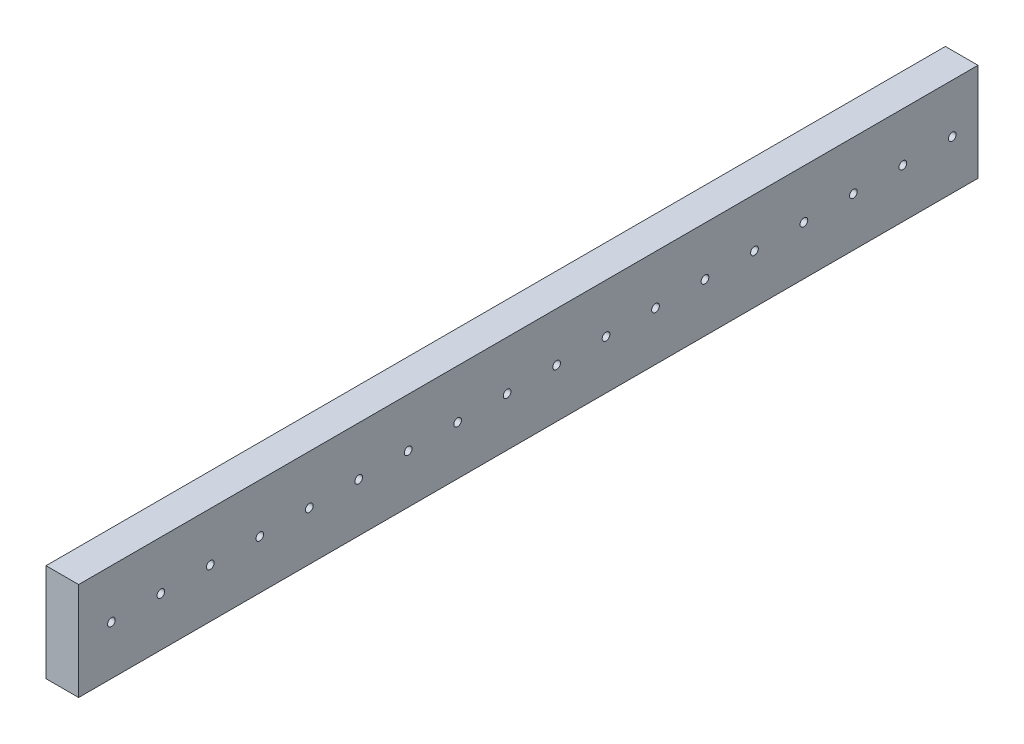
ISO-10303-21;
HEADER;
FILE_DESCRIPTION(('STEP AP214'),'2;1');
FILE_NAME('part.step','',(''),(''),'','','');
FILE_SCHEMA(('AUTOMOTIVE_DESIGN { 1 0 10303 214 1 1 1 1 }'));
ENDSEC;
DATA;
#1=APPLICATION_CONTEXT('core data for automotive mechanical design processes');
#2=APPLICATION_PROTOCOL_DEFINITION('international standard','automotive_design',2000,#1);
#3=PRODUCT_CONTEXT('',#1,'mechanical');
#4=PRODUCT('Part','Part','',(#3));
#5=PRODUCT_RELATED_PRODUCT_CATEGORY('part','',(#4));
#6=PRODUCT_DEFINITION_FORMATION('','',#4);
#7=PRODUCT_DEFINITION_CONTEXT('part definition',#1,'design');
#8=PRODUCT_DEFINITION('design','',#6,#7);
#9=PRODUCT_DEFINITION_SHAPE('','',#8);
#10=(LENGTH_UNIT() NAMED_UNIT(*) SI_UNIT(.MILLI.,.METRE.));
#11=(NAMED_UNIT(*) PLANE_ANGLE_UNIT() SI_UNIT($,.RADIAN.));
#12=(NAMED_UNIT(*) SI_UNIT($,.STERADIAN.) SOLID_ANGLE_UNIT());
#13=UNCERTAINTY_MEASURE_WITH_UNIT(LENGTH_MEASURE(1.E-05),#10,'distance_accuracy_value','');
#14=(GEOMETRIC_REPRESENTATION_CONTEXT(3) GLOBAL_UNCERTAINTY_ASSIGNED_CONTEXT((#13)) GLOBAL_UNIT_ASSIGNED_CONTEXT((#10,
#11,#12)) REPRESENTATION_CONTEXT('',''));
#15=CARTESIAN_POINT('',(0.,0.,0.));
#16=DIRECTION('',(0.,0.,1.));
#17=DIRECTION('',(1.,0.,0.));
#18=AXIS2_PLACEMENT_3D('',#15,#16,#17);
#19=CARTESIAN_POINT('',(12.7,-38.1,-700.));
#20=DIRECTION('',(1.,0.,0.));
#21=DIRECTION('',(0.,0.,-1.));
#22=AXIS2_PLACEMENT_3D('',#19,#20,#21);
#23=PLANE('',#22);
#24=CARTESIAN_POINT('',(12.7,0.,-25.5));
#25=DIRECTION('',(-1.,0.,0.));
#26=DIRECTION('',(0.,0.,1.));
#27=AXIS2_PLACEMENT_3D('',#24,#25,#26);
#28=CIRCLE('',#27,3.00000000000005);
#29=CARTESIAN_POINT('',(12.7,0.,-22.4999999999999));
#30=VERTEX_POINT('',#29);
#31=EDGE_CURVE('E205',#30,#30,#28,.T.);
#32=ORIENTED_EDGE('',*,*,#31,.T.);
#33=EDGE_LOOP('',(#32));
#34=FACE_BOUND('',#33,.T.);
#35=CARTESIAN_POINT('',(12.7,0.,-102.5));
#36=DIRECTION('',(-1.,0.,0.));
#37=DIRECTION('',(0.,0.,1.));
#38=AXIS2_PLACEMENT_3D('',#35,#36,#37);
#39=CIRCLE('',#38,3.00000000000005);
#40=CARTESIAN_POINT('',(12.7,0.,-99.4999999999999));
#41=VERTEX_POINT('',#40);
#42=EDGE_CURVE('E213',#41,#41,#39,.T.);
#43=ORIENTED_EDGE('',*,*,#42,.T.);
#44=EDGE_LOOP('',(#43));
#45=FACE_BOUND('',#44,.T.);
#46=CARTESIAN_POINT('',(12.7,0.,-141.));
#47=DIRECTION('',(-1.,0.,0.));
#48=DIRECTION('',(0.,0.,1.));
#49=AXIS2_PLACEMENT_3D('',#46,#47,#48);
#50=CIRCLE('',#49,3.00000000000005);
#51=CARTESIAN_POINT('',(12.7,0.,-138.));
#52=VERTEX_POINT('',#51);
#53=EDGE_CURVE('E219',#52,#52,#50,.T.);
#54=ORIENTED_EDGE('',*,*,#53,.T.);
#55=EDGE_LOOP('',(#54));
#56=FACE_BOUND('',#55,.T.);
#57=CARTESIAN_POINT('',(12.7,0.,-179.5));
#58=DIRECTION('',(-1.,0.,0.));
#59=DIRECTION('',(0.,0.,1.));
#60=AXIS2_PLACEMENT_3D('',#57,#58,#59);
#61=CIRCLE('',#60,3.00000000000005);
#62=CARTESIAN_POINT('',(12.7,0.,-176.5));
#63=VERTEX_POINT('',#62);
#64=EDGE_CURVE('E225',#63,#63,#61,.T.);
#65=ORIENTED_EDGE('',*,*,#64,.T.);
#66=EDGE_LOOP('',(#65));
#67=FACE_BOUND('',#66,.T.);
#68=CARTESIAN_POINT('',(12.7,0.,-218.));
#69=DIRECTION('',(-1.,0.,0.));
#70=DIRECTION('',(0.,0.,1.));
#71=AXIS2_PLACEMENT_3D('',#68,#69,#70);
#72=CIRCLE('',#71,3.00000000000005);
#73=CARTESIAN_POINT('',(12.7,0.,-215.));
#74=VERTEX_POINT('',#73);
#75=EDGE_CURVE('E231',#74,#74,#72,.T.);
#76=ORIENTED_EDGE('',*,*,#75,.T.);
#77=EDGE_LOOP('',(#76));
#78=FACE_BOUND('',#77,.T.);
#79=CARTESIAN_POINT('',(12.7,0.,-256.5));
#80=DIRECTION('',(-1.,0.,0.));
#81=DIRECTION('',(0.,0.,1.));
#82=AXIS2_PLACEMENT_3D('',#79,#80,#81);
#83=CIRCLE('',#82,3.00000000000005);
#84=CARTESIAN_POINT('',(12.7,0.,-253.5));
#85=VERTEX_POINT('',#84);
#86=EDGE_CURVE('E237',#85,#85,#83,.T.);
#87=ORIENTED_EDGE('',*,*,#86,.T.);
#88=EDGE_LOOP('',(#87));
#89=FACE_BOUND('',#88,.T.);
#90=CARTESIAN_POINT('',(12.7,0.,-295.));
#91=DIRECTION('',(-1.,0.,0.));
#92=DIRECTION('',(0.,0.,1.));
#93=AXIS2_PLACEMENT_3D('',#90,#91,#92);
#94=CIRCLE('',#93,3.00000000000005);
#95=CARTESIAN_POINT('',(12.7,0.,-292.));
#96=VERTEX_POINT('',#95);
#97=EDGE_CURVE('E243',#96,#96,#94,.T.);
#98=ORIENTED_EDGE('',*,*,#97,.T.);
#99=EDGE_LOOP('',(#98));
#100=FACE_BOUND('',#99,.T.);
#101=CARTESIAN_POINT('',(12.7,0.,-333.5));
#102=DIRECTION('',(-1.,0.,0.));
#103=DIRECTION('',(0.,0.,1.));
#104=AXIS2_PLACEMENT_3D('',#101,#102,#103);
#105=CIRCLE('',#104,3.00000000000005);
#106=CARTESIAN_POINT('',(12.7,0.,-330.5));
#107=VERTEX_POINT('',#106);
#108=EDGE_CURVE('E249',#107,#107,#105,.T.);
#109=ORIENTED_EDGE('',*,*,#108,.T.);
#110=EDGE_LOOP('',(#109));
#111=FACE_BOUND('',#110,.T.);
#112=CARTESIAN_POINT('',(12.7,0.,-372.));
#113=DIRECTION('',(-1.,0.,0.));
#114=DIRECTION('',(0.,0.,1.));
#115=AXIS2_PLACEMENT_3D('',#112,#113,#114);
#116=CIRCLE('',#115,3.00000000000005);
#117=CARTESIAN_POINT('',(12.7,0.,-369.));
#118=VERTEX_POINT('',#117);
#119=EDGE_CURVE('E255',#118,#118,#116,.T.);
#120=ORIENTED_EDGE('',*,*,#119,.T.);
#121=EDGE_LOOP('',(#120));
#122=FACE_BOUND('',#121,.T.);
#123=CARTESIAN_POINT('',(12.7,0.,-410.5));
#124=DIRECTION('',(-1.,0.,0.));
#125=DIRECTION('',(0.,0.,1.));
#126=AXIS2_PLACEMENT_3D('',#123,#124,#125);
#127=CIRCLE('',#126,3.00000000000005);
#128=CARTESIAN_POINT('',(12.7,0.,-407.5));
#129=VERTEX_POINT('',#128);
#130=EDGE_CURVE('E261',#129,#129,#127,.T.);
#131=ORIENTED_EDGE('',*,*,#130,.T.);
#132=EDGE_LOOP('',(#131));
#133=FACE_BOUND('',#132,.T.);
#134=CARTESIAN_POINT('',(12.7,0.,-449.));
#135=DIRECTION('',(-1.,0.,0.));
#136=DIRECTION('',(0.,0.,1.));
#137=AXIS2_PLACEMENT_3D('',#134,#135,#136);
#138=CIRCLE('',#137,3.00000000000005);
#139=CARTESIAN_POINT('',(12.7,0.,-446.));
#140=VERTEX_POINT('',#139);
#141=EDGE_CURVE('E267',#140,#140,#138,.T.);
#142=ORIENTED_EDGE('',*,*,#141,.T.);
#143=EDGE_LOOP('',(#142));
#144=FACE_BOUND('',#143,.T.);
#145=CARTESIAN_POINT('',(12.7,0.,-487.5));
#146=DIRECTION('',(-1.,0.,0.));
#147=DIRECTION('',(0.,0.,1.));
#148=AXIS2_PLACEMENT_3D('',#145,#146,#147);
#149=CIRCLE('',#148,3.00000000000005);
#150=CARTESIAN_POINT('',(12.7,0.,-484.5));
#151=VERTEX_POINT('',#150);
#152=EDGE_CURVE('E273',#151,#151,#149,.T.);
#153=ORIENTED_EDGE('',*,*,#152,.T.);
#154=EDGE_LOOP('',(#153));
#155=FACE_BOUND('',#154,.T.);
#156=CARTESIAN_POINT('',(12.7,0.,-526.));
#157=DIRECTION('',(-1.,0.,0.));
#158=DIRECTION('',(0.,0.,1.));
#159=AXIS2_PLACEMENT_3D('',#156,#157,#158);
#160=CIRCLE('',#159,3.00000000000005);
#161=CARTESIAN_POINT('',(12.7,0.,-523.));
#162=VERTEX_POINT('',#161);
#163=EDGE_CURVE('E279',#162,#162,#160,.T.);
#164=ORIENTED_EDGE('',*,*,#163,.T.);
#165=EDGE_LOOP('',(#164));
#166=FACE_BOUND('',#165,.T.);
#167=CARTESIAN_POINT('',(12.7,0.,-564.5));
#168=DIRECTION('',(-1.,0.,0.));
#169=DIRECTION('',(0.,0.,1.));
#170=AXIS2_PLACEMENT_3D('',#167,#168,#169);
#171=CIRCLE('',#170,2.99999999999993);
#172=CARTESIAN_POINT('',(12.7,0.,-561.5));
#173=VERTEX_POINT('',#172);
#174=EDGE_CURVE('E285',#173,#173,#171,.T.);
#175=ORIENTED_EDGE('',*,*,#174,.T.);
#176=EDGE_LOOP('',(#175));
#177=FACE_BOUND('',#176,.T.);
#178=CARTESIAN_POINT('',(12.7,0.,-603.));
#179=DIRECTION('',(-1.,0.,0.));
#180=DIRECTION('',(0.,0.,1.));
#181=AXIS2_PLACEMENT_3D('',#178,#179,#180);
#182=CIRCLE('',#181,3.00000000000005);
#183=CARTESIAN_POINT('',(12.7,0.,-600.));
#184=VERTEX_POINT('',#183);
#185=EDGE_CURVE('E291',#184,#184,#182,.T.);
#186=ORIENTED_EDGE('',*,*,#185,.T.);
#187=EDGE_LOOP('',(#186));
#188=FACE_BOUND('',#187,.T.);
#189=CARTESIAN_POINT('',(12.7,0.,-641.5));
#190=DIRECTION('',(-1.,0.,0.));
#191=DIRECTION('',(0.,0.,1.));
#192=AXIS2_PLACEMENT_3D('',#189,#190,#191);
#193=CIRCLE('',#192,3.00000000000005);
#194=CARTESIAN_POINT('',(12.7,0.,-638.5));
#195=VERTEX_POINT('',#194);
#196=EDGE_CURVE('E297',#195,#195,#193,.T.);
#197=ORIENTED_EDGE('',*,*,#196,.T.);
#198=EDGE_LOOP('',(#197));
#199=FACE_BOUND('',#198,.T.);
#200=CARTESIAN_POINT('',(12.7,0.,-63.9999999999999));
#201=DIRECTION('',(-1.,0.,0.));
#202=DIRECTION('',(0.,0.,1.));
#203=AXIS2_PLACEMENT_3D('',#200,#201,#202);
#204=CIRCLE('',#203,3.00000000000005);
#205=CARTESIAN_POINT('',(12.7,0.,-60.9999999999999));
#206=VERTEX_POINT('',#205);
#207=EDGE_CURVE('E303',#206,#206,#204,.T.);
#208=ORIENTED_EDGE('',*,*,#207,.T.);
#209=EDGE_LOOP('',(#208));
#210=FACE_BOUND('',#209,.T.);
#211=CARTESIAN_POINT('',(12.7,0.,-680.));
#212=DIRECTION('',(-1.,0.,0.));
#213=DIRECTION('',(0.,0.,1.));
#214=AXIS2_PLACEMENT_3D('',#211,#212,#213);
#215=CIRCLE('',#214,3.00000000000005);
#216=CARTESIAN_POINT('',(12.7,0.,-677.));
#217=VERTEX_POINT('',#216);
#218=EDGE_CURVE('E102',#217,#217,#215,.T.);
#219=ORIENTED_EDGE('',*,*,#218,.T.);
#220=EDGE_LOOP('',(#219));
#221=FACE_BOUND('',#220,.T.);
#222=DIRECTION('',(0.,1.,0.));
#223=VECTOR('',#222,1.);
#224=CARTESIAN_POINT('',(12.7,-38.1,0.));
#225=LINE('',#224,#223);
#226=CARTESIAN_POINT('',(12.7,-38.1,0.));
#227=VERTEX_POINT('',#226);
#228=CARTESIAN_POINT('',(12.7,38.1,0.));
#229=VERTEX_POINT('',#228);
#230=EDGE_CURVE('E98',#227,#229,#225,.T.);
#231=ORIENTED_EDGE('',*,*,#230,.F.);
#232=DIRECTION('',(0.,0.,1.));
#233=VECTOR('',#232,1.);
#234=CARTESIAN_POINT('',(12.7,-38.1,-700.));
#235=LINE('',#234,#233);
#236=CARTESIAN_POINT('',(12.7,-38.1,-700.));
#237=VERTEX_POINT('',#236);
#238=EDGE_CURVE('E11',#237,#227,#235,.T.);
#239=ORIENTED_EDGE('',*,*,#238,.F.);
#240=DIRECTION('',(0.,1.,0.));
#241=VECTOR('',#240,1.);
#242=CARTESIAN_POINT('',(12.7,-38.1,-700.));
#243=LINE('',#242,#241);
#244=CARTESIAN_POINT('',(12.7,38.1,-700.));
#245=VERTEX_POINT('',#244);
#246=EDGE_CURVE('E91',#237,#245,#243,.T.);
#247=ORIENTED_EDGE('',*,*,#246,.T.);
#248=DIRECTION('',(0.,0.,1.));
#249=VECTOR('',#248,1.);
#250=CARTESIAN_POINT('',(12.7,38.1,-700.));
#251=LINE('',#250,#249);
#252=EDGE_CURVE('E36',#245,#229,#251,.T.);
#253=ORIENTED_EDGE('',*,*,#252,.T.);
#254=EDGE_LOOP('',(#231,#239,#247,#253));
#255=FACE_BOUND('',#254,.T.);
#256=ADVANCED_FACE('F33',(#34,#45,#56,#67,#78,#89,#100,#111,#122,#133,#144,#155,#166,#177,#188,
#199,#210,#221,#255),#23,.T.);
#257=CARTESIAN_POINT('',(-12.7,-38.1,-700.));
#258=DIRECTION('',(0.,-1.,0.));
#259=DIRECTION('',(0.,0.,-1.));
#260=AXIS2_PLACEMENT_3D('',#257,#258,#259);
#261=PLANE('',#260);
#262=DIRECTION('',(1.,0.,0.));
#263=VECTOR('',#262,1.);
#264=CARTESIAN_POINT('',(-12.7,-38.1,0.));
#265=LINE('',#264,#263);
#266=CARTESIAN_POINT('',(-12.7,-38.1,0.));
#267=VERTEX_POINT('',#266);
#268=EDGE_CURVE('E93',#267,#227,#265,.T.);
#269=ORIENTED_EDGE('',*,*,#268,.F.);
#270=DIRECTION('',(0.,0.,1.));
#271=VECTOR('',#270,1.);
#272=CARTESIAN_POINT('',(-12.7,-38.1,-700.));
#273=LINE('',#272,#271);
#274=CARTESIAN_POINT('',(-12.7,-38.1,-700.));
#275=VERTEX_POINT('',#274);
#276=EDGE_CURVE('E42',#275,#267,#273,.T.);
#277=ORIENTED_EDGE('',*,*,#276,.F.);
#278=DIRECTION('',(1.,0.,0.));
#279=VECTOR('',#278,1.);
#280=CARTESIAN_POINT('',(-12.7,-38.1,-700.));
#281=LINE('',#280,#279);
#282=EDGE_CURVE('E88',#275,#237,#281,.T.);
#283=ORIENTED_EDGE('',*,*,#282,.T.);
#284=ORIENTED_EDGE('',*,*,#238,.T.);
#285=EDGE_LOOP('',(#269,#277,#283,#284));
#286=FACE_BOUND('',#285,.T.);
#287=ADVANCED_FACE('F109',(#286),#261,.T.);
#288=CARTESIAN_POINT('',(-12.7,-38.1,-700.));
#289=DIRECTION('',(-1.,0.,0.));
#290=DIRECTION('',(0.,0.,1.));
#291=AXIS2_PLACEMENT_3D('',#288,#289,#290);
#292=PLANE('',#291);
#293=CARTESIAN_POINT('',(-12.7,0.,-25.5));
#294=DIRECTION('',(-1.,0.,0.));
#295=DIRECTION('',(0.,0.,1.));
#296=AXIS2_PLACEMENT_3D('',#293,#294,#295);
#297=CIRCLE('',#296,3.00000000000005);
#298=CARTESIAN_POINT('',(-12.7,0.,-22.4999999999999));
#299=VERTEX_POINT('',#298);
#300=EDGE_CURVE('E208',#299,#299,#297,.T.);
#301=ORIENTED_EDGE('',*,*,#300,.F.);
#302=EDGE_LOOP('',(#301));
#303=FACE_BOUND('',#302,.T.);
#304=CARTESIAN_POINT('',(-12.7,0.,-102.5));
#305=DIRECTION('',(-1.,0.,0.));
#306=DIRECTION('',(0.,0.,1.));
#307=AXIS2_PLACEMENT_3D('',#304,#305,#306);
#308=CIRCLE('',#307,3.00000000000005);
#309=CARTESIAN_POINT('',(-12.7,0.,-99.4999999999999));
#310=VERTEX_POINT('',#309);
#311=EDGE_CURVE('E210',#310,#310,#308,.T.);
#312=ORIENTED_EDGE('',*,*,#311,.F.);
#313=EDGE_LOOP('',(#312));
#314=FACE_BOUND('',#313,.T.);
#315=CARTESIAN_POINT('',(-12.7,0.,-141.));
#316=DIRECTION('',(-1.,0.,0.));
#317=DIRECTION('',(0.,0.,1.));
#318=AXIS2_PLACEMENT_3D('',#315,#316,#317);
#319=CIRCLE('',#318,3.00000000000005);
#320=CARTESIAN_POINT('',(-12.7,0.,-138.));
#321=VERTEX_POINT('',#320);
#322=EDGE_CURVE('E216',#321,#321,#319,.T.);
#323=ORIENTED_EDGE('',*,*,#322,.F.);
#324=EDGE_LOOP('',(#323));
#325=FACE_BOUND('',#324,.T.);
#326=CARTESIAN_POINT('',(-12.7,0.,-179.5));
#327=DIRECTION('',(-1.,0.,0.));
#328=DIRECTION('',(0.,0.,1.));
#329=AXIS2_PLACEMENT_3D('',#326,#327,#328);
#330=CIRCLE('',#329,3.00000000000005);
#331=CARTESIAN_POINT('',(-12.7,0.,-176.5));
#332=VERTEX_POINT('',#331);
#333=EDGE_CURVE('E222',#332,#332,#330,.T.);
#334=ORIENTED_EDGE('',*,*,#333,.F.);
#335=EDGE_LOOP('',(#334));
#336=FACE_BOUND('',#335,.T.);
#337=CARTESIAN_POINT('',(-12.7,0.,-218.));
#338=DIRECTION('',(-1.,0.,0.));
#339=DIRECTION('',(0.,0.,1.));
#340=AXIS2_PLACEMENT_3D('',#337,#338,#339);
#341=CIRCLE('',#340,3.00000000000005);
#342=CARTESIAN_POINT('',(-12.7,0.,-215.));
#343=VERTEX_POINT('',#342);
#344=EDGE_CURVE('E228',#343,#343,#341,.T.);
#345=ORIENTED_EDGE('',*,*,#344,.F.);
#346=EDGE_LOOP('',(#345));
#347=FACE_BOUND('',#346,.T.);
#348=CARTESIAN_POINT('',(-12.7,0.,-256.5));
#349=DIRECTION('',(-1.,0.,0.));
#350=DIRECTION('',(0.,0.,1.));
#351=AXIS2_PLACEMENT_3D('',#348,#349,#350);
#352=CIRCLE('',#351,3.00000000000005);
#353=CARTESIAN_POINT('',(-12.7,0.,-253.5));
#354=VERTEX_POINT('',#353);
#355=EDGE_CURVE('E234',#354,#354,#352,.T.);
#356=ORIENTED_EDGE('',*,*,#355,.F.);
#357=EDGE_LOOP('',(#356));
#358=FACE_BOUND('',#357,.T.);
#359=CARTESIAN_POINT('',(-12.7,0.,-295.));
#360=DIRECTION('',(-1.,0.,0.));
#361=DIRECTION('',(0.,0.,1.));
#362=AXIS2_PLACEMENT_3D('',#359,#360,#361);
#363=CIRCLE('',#362,3.00000000000005);
#364=CARTESIAN_POINT('',(-12.7,0.,-292.));
#365=VERTEX_POINT('',#364);
#366=EDGE_CURVE('E240',#365,#365,#363,.T.);
#367=ORIENTED_EDGE('',*,*,#366,.F.);
#368=EDGE_LOOP('',(#367));
#369=FACE_BOUND('',#368,.T.);
#370=CARTESIAN_POINT('',(-12.7,0.,-333.5));
#371=DIRECTION('',(-1.,0.,0.));
#372=DIRECTION('',(0.,0.,1.));
#373=AXIS2_PLACEMENT_3D('',#370,#371,#372);
#374=CIRCLE('',#373,3.00000000000005);
#375=CARTESIAN_POINT('',(-12.7,0.,-330.5));
#376=VERTEX_POINT('',#375);
#377=EDGE_CURVE('E246',#376,#376,#374,.T.);
#378=ORIENTED_EDGE('',*,*,#377,.F.);
#379=EDGE_LOOP('',(#378));
#380=FACE_BOUND('',#379,.T.);
#381=CARTESIAN_POINT('',(-12.7,0.,-372.));
#382=DIRECTION('',(-1.,0.,0.));
#383=DIRECTION('',(0.,0.,1.));
#384=AXIS2_PLACEMENT_3D('',#381,#382,#383);
#385=CIRCLE('',#384,3.00000000000005);
#386=CARTESIAN_POINT('',(-12.7,0.,-369.));
#387=VERTEX_POINT('',#386);
#388=EDGE_CURVE('E252',#387,#387,#385,.T.);
#389=ORIENTED_EDGE('',*,*,#388,.F.);
#390=EDGE_LOOP('',(#389));
#391=FACE_BOUND('',#390,.T.);
#392=CARTESIAN_POINT('',(-12.7,0.,-410.5));
#393=DIRECTION('',(-1.,0.,0.));
#394=DIRECTION('',(0.,0.,1.));
#395=AXIS2_PLACEMENT_3D('',#392,#393,#394);
#396=CIRCLE('',#395,3.00000000000005);
#397=CARTESIAN_POINT('',(-12.7,0.,-407.5));
#398=VERTEX_POINT('',#397);
#399=EDGE_CURVE('E258',#398,#398,#396,.T.);
#400=ORIENTED_EDGE('',*,*,#399,.F.);
#401=EDGE_LOOP('',(#400));
#402=FACE_BOUND('',#401,.T.);
#403=CARTESIAN_POINT('',(-12.7,0.,-449.));
#404=DIRECTION('',(-1.,0.,0.));
#405=DIRECTION('',(0.,0.,1.));
#406=AXIS2_PLACEMENT_3D('',#403,#404,#405);
#407=CIRCLE('',#406,3.00000000000005);
#408=CARTESIAN_POINT('',(-12.7,0.,-446.));
#409=VERTEX_POINT('',#408);
#410=EDGE_CURVE('E264',#409,#409,#407,.T.);
#411=ORIENTED_EDGE('',*,*,#410,.F.);
#412=EDGE_LOOP('',(#411));
#413=FACE_BOUND('',#412,.T.);
#414=CARTESIAN_POINT('',(-12.7,0.,-487.5));
#415=DIRECTION('',(-1.,0.,0.));
#416=DIRECTION('',(0.,0.,1.));
#417=AXIS2_PLACEMENT_3D('',#414,#415,#416);
#418=CIRCLE('',#417,3.00000000000005);
#419=CARTESIAN_POINT('',(-12.7,0.,-484.5));
#420=VERTEX_POINT('',#419);
#421=EDGE_CURVE('E270',#420,#420,#418,.T.);
#422=ORIENTED_EDGE('',*,*,#421,.F.);
#423=EDGE_LOOP('',(#422));
#424=FACE_BOUND('',#423,.T.);
#425=CARTESIAN_POINT('',(-12.7,0.,-526.));
#426=DIRECTION('',(-1.,0.,0.));
#427=DIRECTION('',(0.,0.,1.));
#428=AXIS2_PLACEMENT_3D('',#425,#426,#427);
#429=CIRCLE('',#428,3.00000000000005);
#430=CARTESIAN_POINT('',(-12.7,0.,-523.));
#431=VERTEX_POINT('',#430);
#432=EDGE_CURVE('E276',#431,#431,#429,.T.);
#433=ORIENTED_EDGE('',*,*,#432,.F.);
#434=EDGE_LOOP('',(#433));
#435=FACE_BOUND('',#434,.T.);
#436=CARTESIAN_POINT('',(-12.7,0.,-564.5));
#437=DIRECTION('',(-1.,0.,0.));
#438=DIRECTION('',(0.,0.,1.));
#439=AXIS2_PLACEMENT_3D('',#436,#437,#438);
#440=CIRCLE('',#439,2.99999999999993);
#441=CARTESIAN_POINT('',(-12.7,0.,-561.5));
#442=VERTEX_POINT('',#441);
#443=EDGE_CURVE('E282',#442,#442,#440,.T.);
#444=ORIENTED_EDGE('',*,*,#443,.F.);
#445=EDGE_LOOP('',(#444));
#446=FACE_BOUND('',#445,.T.);
#447=CARTESIAN_POINT('',(-12.7,0.,-603.));
#448=DIRECTION('',(-1.,0.,0.));
#449=DIRECTION('',(0.,0.,1.));
#450=AXIS2_PLACEMENT_3D('',#447,#448,#449);
#451=CIRCLE('',#450,3.00000000000005);
#452=CARTESIAN_POINT('',(-12.7,0.,-600.));
#453=VERTEX_POINT('',#452);
#454=EDGE_CURVE('E288',#453,#453,#451,.T.);
#455=ORIENTED_EDGE('',*,*,#454,.F.);
#456=EDGE_LOOP('',(#455));
#457=FACE_BOUND('',#456,.T.);
#458=CARTESIAN_POINT('',(-12.7,0.,-641.5));
#459=DIRECTION('',(-1.,0.,0.));
#460=DIRECTION('',(0.,0.,1.));
#461=AXIS2_PLACEMENT_3D('',#458,#459,#460);
#462=CIRCLE('',#461,3.00000000000005);
#463=CARTESIAN_POINT('',(-12.7,0.,-638.5));
#464=VERTEX_POINT('',#463);
#465=EDGE_CURVE('E294',#464,#464,#462,.T.);
#466=ORIENTED_EDGE('',*,*,#465,.F.);
#467=EDGE_LOOP('',(#466));
#468=FACE_BOUND('',#467,.T.);
#469=CARTESIAN_POINT('',(-12.7,0.,-63.9999999999999));
#470=DIRECTION('',(-1.,0.,0.));
#471=DIRECTION('',(0.,0.,1.));
#472=AXIS2_PLACEMENT_3D('',#469,#470,#471);
#473=CIRCLE('',#472,3.00000000000005);
#474=CARTESIAN_POINT('',(-12.7,0.,-60.9999999999999));
#475=VERTEX_POINT('',#474);
#476=EDGE_CURVE('E300',#475,#475,#473,.T.);
#477=ORIENTED_EDGE('',*,*,#476,.F.);
#478=EDGE_LOOP('',(#477));
#479=FACE_BOUND('',#478,.T.);
#480=CARTESIAN_POINT('',(-12.7,0.,-680.));
#481=DIRECTION('',(-1.,0.,0.));
#482=DIRECTION('',(0.,0.,1.));
#483=AXIS2_PLACEMENT_3D('',#480,#481,#482);
#484=CIRCLE('',#483,3.00000000000005);
#485=CARTESIAN_POINT('',(-12.7,0.,-677.));
#486=VERTEX_POINT('',#485);
#487=EDGE_CURVE('E306',#486,#486,#484,.T.);
#488=ORIENTED_EDGE('',*,*,#487,.F.);
#489=EDGE_LOOP('',(#488));
#490=FACE_BOUND('',#489,.T.);
#491=DIRECTION('',(0.,-1.,0.));
#492=VECTOR('',#491,1.);
#493=CARTESIAN_POINT('',(-12.7,-38.1,0.));
#494=LINE('',#493,#492);
#495=CARTESIAN_POINT('',(-12.7,38.1,0.));
#496=VERTEX_POINT('',#495);
#497=EDGE_CURVE('E83',#496,#267,#494,.T.);
#498=ORIENTED_EDGE('',*,*,#497,.F.);
#499=DIRECTION('',(0.,0.,1.));
#500=VECTOR('',#499,1.);
#501=CARTESIAN_POINT('',(-12.7,38.1,-700.));
#502=LINE('',#501,#500);
#503=CARTESIAN_POINT('',(-12.7,38.1,-700.));
#504=VERTEX_POINT('',#503);
#505=EDGE_CURVE('E78',#504,#496,#502,.T.);
#506=ORIENTED_EDGE('',*,*,#505,.F.);
#507=DIRECTION('',(0.,-1.,0.));
#508=VECTOR('',#507,1.);
#509=CARTESIAN_POINT('',(-12.7,-38.1,-700.));
#510=LINE('',#509,#508);
#511=EDGE_CURVE('E81',#504,#275,#510,.T.);
#512=ORIENTED_EDGE('',*,*,#511,.T.);
#513=ORIENTED_EDGE('',*,*,#276,.T.);
#514=EDGE_LOOP('',(#498,#506,#512,#513));
#515=FACE_BOUND('',#514,.T.);
#516=ADVANCED_FACE('F80',(#303,#314,#325,#336,#347,#358,#369,#380,#391,#402,#413,#424,#435,#446,
#457,#468,#479,#490,#515),#292,.T.);
#517=CARTESIAN_POINT('',(-12.7,38.1,-700.));
#518=DIRECTION('',(0.,1.,0.));
#519=DIRECTION('',(0.,0.,1.));
#520=AXIS2_PLACEMENT_3D('',#517,#518,#519);
#521=PLANE('',#520);
#522=DIRECTION('',(-1.,0.,0.));
#523=VECTOR('',#522,1.);
#524=CARTESIAN_POINT('',(-12.7,38.1,0.));
#525=LINE('',#524,#523);
#526=EDGE_CURVE('E101',#229,#496,#525,.T.);
#527=ORIENTED_EDGE('',*,*,#526,.F.);
#528=ORIENTED_EDGE('',*,*,#252,.F.);
#529=DIRECTION('',(-1.,0.,0.));
#530=VECTOR('',#529,1.);
#531=CARTESIAN_POINT('',(-12.7,38.1,-700.));
#532=LINE('',#531,#530);
#533=EDGE_CURVE('E87',#245,#504,#532,.T.);
#534=ORIENTED_EDGE('',*,*,#533,.T.);
#535=ORIENTED_EDGE('',*,*,#505,.T.);
#536=EDGE_LOOP('',(#527,#528,#534,#535));
#537=FACE_BOUND('',#536,.T.);
#538=ADVANCED_FACE('F90',(#537),#521,.T.);
#539=CARTESIAN_POINT('',(0.,0.,-700.));
#540=DIRECTION('',(0.,0.,-1.));
#541=DIRECTION('',(-1.,0.,0.));
#542=AXIS2_PLACEMENT_3D('',#539,#540,#541);
#543=PLANE('',#542);
#544=ORIENTED_EDGE('',*,*,#246,.F.);
#545=ORIENTED_EDGE('',*,*,#282,.F.);
#546=ORIENTED_EDGE('',*,*,#511,.F.);
#547=ORIENTED_EDGE('',*,*,#533,.F.);
#548=EDGE_LOOP('',(#544,#545,#546,#547));
#549=FACE_BOUND('',#548,.T.);
#550=ADVANCED_FACE('F86',(#549),#543,.T.);
#551=CARTESIAN_POINT('',(0.,0.,0.));
#552=DIRECTION('',(0.,0.,-1.));
#553=DIRECTION('',(-1.,0.,0.));
#554=AXIS2_PLACEMENT_3D('',#551,#552,#553);
#555=PLANE('',#554);
#556=ORIENTED_EDGE('',*,*,#230,.T.);
#557=ORIENTED_EDGE('',*,*,#526,.T.);
#558=ORIENTED_EDGE('',*,*,#497,.T.);
#559=ORIENTED_EDGE('',*,*,#268,.T.);
#560=EDGE_LOOP('',(#556,#557,#558,#559));
#561=FACE_BOUND('',#560,.T.);
#562=ADVANCED_FACE('F108',(#561),#555,.F.);
#563=CARTESIAN_POINT('',(12.7,0.,-680.));
#564=DIRECTION('',(-1.,0.,0.));
#565=DIRECTION('',(0.,0.,1.));
#566=AXIS2_PLACEMENT_3D('',#563,#564,#565);
#567=CYLINDRICAL_SURFACE('',#566,3.00000000000005);
#568=ORIENTED_EDGE('',*,*,#218,.F.);
#569=EDGE_LOOP('',(#568));
#570=FACE_BOUND('',#569,.T.);
#571=ORIENTED_EDGE('',*,*,#487,.T.);
#572=EDGE_LOOP('',(#571));
#573=FACE_BOUND('',#572,.T.);
#574=ADVANCED_FACE('F128',(#570,#573),#567,.F.);
#575=CARTESIAN_POINT('',(12.7,0.,-63.9999999999999));
#576=DIRECTION('',(-1.,0.,0.));
#577=DIRECTION('',(0.,0.,1.));
#578=AXIS2_PLACEMENT_3D('',#575,#576,#577);
#579=CYLINDRICAL_SURFACE('',#578,3.00000000000005);
#580=ORIENTED_EDGE('',*,*,#207,.F.);
#581=EDGE_LOOP('',(#580));
#582=FACE_BOUND('',#581,.T.);
#583=ORIENTED_EDGE('',*,*,#476,.T.);
#584=EDGE_LOOP('',(#583));
#585=FACE_BOUND('',#584,.T.);
#586=ADVANCED_FACE('F132',(#582,#585),#579,.F.);
#587=CARTESIAN_POINT('',(12.7,0.,-641.5));
#588=DIRECTION('',(-1.,0.,0.));
#589=DIRECTION('',(0.,0.,1.));
#590=AXIS2_PLACEMENT_3D('',#587,#588,#589);
#591=CYLINDRICAL_SURFACE('',#590,3.00000000000005);
#592=ORIENTED_EDGE('',*,*,#196,.F.);
#593=EDGE_LOOP('',(#592));
#594=FACE_BOUND('',#593,.T.);
#595=ORIENTED_EDGE('',*,*,#465,.T.);
#596=EDGE_LOOP('',(#595));
#597=FACE_BOUND('',#596,.T.);
#598=ADVANCED_FACE('F136',(#594,#597),#591,.F.);
#599=CARTESIAN_POINT('',(12.7,0.,-603.));
#600=DIRECTION('',(-1.,0.,0.));
#601=DIRECTION('',(0.,0.,1.));
#602=AXIS2_PLACEMENT_3D('',#599,#600,#601);
#603=CYLINDRICAL_SURFACE('',#602,3.00000000000005);
#604=ORIENTED_EDGE('',*,*,#185,.F.);
#605=EDGE_LOOP('',(#604));
#606=FACE_BOUND('',#605,.T.);
#607=ORIENTED_EDGE('',*,*,#454,.T.);
#608=EDGE_LOOP('',(#607));
#609=FACE_BOUND('',#608,.T.);
#610=ADVANCED_FACE('F140',(#606,#609),#603,.F.);
#611=CARTESIAN_POINT('',(12.7,0.,-564.5));
#612=DIRECTION('',(-1.,0.,0.));
#613=DIRECTION('',(0.,0.,1.));
#614=AXIS2_PLACEMENT_3D('',#611,#612,#613);
#615=CYLINDRICAL_SURFACE('',#614,2.99999999999993);
#616=ORIENTED_EDGE('',*,*,#174,.F.);
#617=EDGE_LOOP('',(#616));
#618=FACE_BOUND('',#617,.T.);
#619=ORIENTED_EDGE('',*,*,#443,.T.);
#620=EDGE_LOOP('',(#619));
#621=FACE_BOUND('',#620,.T.);
#622=ADVANCED_FACE('F144',(#618,#621),#615,.F.);
#623=CARTESIAN_POINT('',(12.7,0.,-526.));
#624=DIRECTION('',(-1.,0.,0.));
#625=DIRECTION('',(0.,0.,1.));
#626=AXIS2_PLACEMENT_3D('',#623,#624,#625);
#627=CYLINDRICAL_SURFACE('',#626,3.00000000000005);
#628=ORIENTED_EDGE('',*,*,#163,.F.);
#629=EDGE_LOOP('',(#628));
#630=FACE_BOUND('',#629,.T.);
#631=ORIENTED_EDGE('',*,*,#432,.T.);
#632=EDGE_LOOP('',(#631));
#633=FACE_BOUND('',#632,.T.);
#634=ADVANCED_FACE('F148',(#630,#633),#627,.F.);
#635=CARTESIAN_POINT('',(12.7,0.,-487.5));
#636=DIRECTION('',(-1.,0.,0.));
#637=DIRECTION('',(0.,0.,1.));
#638=AXIS2_PLACEMENT_3D('',#635,#636,#637);
#639=CYLINDRICAL_SURFACE('',#638,3.00000000000005);
#640=ORIENTED_EDGE('',*,*,#152,.F.);
#641=EDGE_LOOP('',(#640));
#642=FACE_BOUND('',#641,.T.);
#643=ORIENTED_EDGE('',*,*,#421,.T.);
#644=EDGE_LOOP('',(#643));
#645=FACE_BOUND('',#644,.T.);
#646=ADVANCED_FACE('F152',(#642,#645),#639,.F.);
#647=CARTESIAN_POINT('',(12.7,0.,-449.));
#648=DIRECTION('',(-1.,0.,0.));
#649=DIRECTION('',(0.,0.,1.));
#650=AXIS2_PLACEMENT_3D('',#647,#648,#649);
#651=CYLINDRICAL_SURFACE('',#650,3.00000000000005);
#652=ORIENTED_EDGE('',*,*,#141,.F.);
#653=EDGE_LOOP('',(#652));
#654=FACE_BOUND('',#653,.T.);
#655=ORIENTED_EDGE('',*,*,#410,.T.);
#656=EDGE_LOOP('',(#655));
#657=FACE_BOUND('',#656,.T.);
#658=ADVANCED_FACE('F156',(#654,#657),#651,.F.);
#659=CARTESIAN_POINT('',(12.7,0.,-410.5));
#660=DIRECTION('',(-1.,0.,0.));
#661=DIRECTION('',(0.,0.,1.));
#662=AXIS2_PLACEMENT_3D('',#659,#660,#661);
#663=CYLINDRICAL_SURFACE('',#662,3.00000000000005);
#664=ORIENTED_EDGE('',*,*,#130,.F.);
#665=EDGE_LOOP('',(#664));
#666=FACE_BOUND('',#665,.T.);
#667=ORIENTED_EDGE('',*,*,#399,.T.);
#668=EDGE_LOOP('',(#667));
#669=FACE_BOUND('',#668,.T.);
#670=ADVANCED_FACE('F160',(#666,#669),#663,.F.);
#671=CARTESIAN_POINT('',(12.7,0.,-372.));
#672=DIRECTION('',(-1.,0.,0.));
#673=DIRECTION('',(0.,0.,1.));
#674=AXIS2_PLACEMENT_3D('',#671,#672,#673);
#675=CYLINDRICAL_SURFACE('',#674,3.00000000000005);
#676=ORIENTED_EDGE('',*,*,#119,.F.);
#677=EDGE_LOOP('',(#676));
#678=FACE_BOUND('',#677,.T.);
#679=ORIENTED_EDGE('',*,*,#388,.T.);
#680=EDGE_LOOP('',(#679));
#681=FACE_BOUND('',#680,.T.);
#682=ADVANCED_FACE('F164',(#678,#681),#675,.F.);
#683=CARTESIAN_POINT('',(12.7,0.,-333.5));
#684=DIRECTION('',(-1.,0.,0.));
#685=DIRECTION('',(0.,0.,1.));
#686=AXIS2_PLACEMENT_3D('',#683,#684,#685);
#687=CYLINDRICAL_SURFACE('',#686,3.00000000000005);
#688=ORIENTED_EDGE('',*,*,#108,.F.);
#689=EDGE_LOOP('',(#688));
#690=FACE_BOUND('',#689,.T.);
#691=ORIENTED_EDGE('',*,*,#377,.T.);
#692=EDGE_LOOP('',(#691));
#693=FACE_BOUND('',#692,.T.);
#694=ADVANCED_FACE('F168',(#690,#693),#687,.F.);
#695=CARTESIAN_POINT('',(12.7,0.,-295.));
#696=DIRECTION('',(-1.,0.,0.));
#697=DIRECTION('',(0.,0.,1.));
#698=AXIS2_PLACEMENT_3D('',#695,#696,#697);
#699=CYLINDRICAL_SURFACE('',#698,3.00000000000005);
#700=ORIENTED_EDGE('',*,*,#97,.F.);
#701=EDGE_LOOP('',(#700));
#702=FACE_BOUND('',#701,.T.);
#703=ORIENTED_EDGE('',*,*,#366,.T.);
#704=EDGE_LOOP('',(#703));
#705=FACE_BOUND('',#704,.T.);
#706=ADVANCED_FACE('F172',(#702,#705),#699,.F.);
#707=CARTESIAN_POINT('',(12.7,0.,-256.5));
#708=DIRECTION('',(-1.,0.,0.));
#709=DIRECTION('',(0.,0.,1.));
#710=AXIS2_PLACEMENT_3D('',#707,#708,#709);
#711=CYLINDRICAL_SURFACE('',#710,3.00000000000005);
#712=ORIENTED_EDGE('',*,*,#86,.F.);
#713=EDGE_LOOP('',(#712));
#714=FACE_BOUND('',#713,.T.);
#715=ORIENTED_EDGE('',*,*,#355,.T.);
#716=EDGE_LOOP('',(#715));
#717=FACE_BOUND('',#716,.T.);
#718=ADVANCED_FACE('F176',(#714,#717),#711,.F.);
#719=CARTESIAN_POINT('',(12.7,0.,-218.));
#720=DIRECTION('',(-1.,0.,0.));
#721=DIRECTION('',(0.,0.,1.));
#722=AXIS2_PLACEMENT_3D('',#719,#720,#721);
#723=CYLINDRICAL_SURFACE('',#722,3.00000000000005);
#724=ORIENTED_EDGE('',*,*,#75,.F.);
#725=EDGE_LOOP('',(#724));
#726=FACE_BOUND('',#725,.T.);
#727=ORIENTED_EDGE('',*,*,#344,.T.);
#728=EDGE_LOOP('',(#727));
#729=FACE_BOUND('',#728,.T.);
#730=ADVANCED_FACE('F180',(#726,#729),#723,.F.);
#731=CARTESIAN_POINT('',(12.7,0.,-179.5));
#732=DIRECTION('',(-1.,0.,0.));
#733=DIRECTION('',(0.,0.,1.));
#734=AXIS2_PLACEMENT_3D('',#731,#732,#733);
#735=CYLINDRICAL_SURFACE('',#734,3.00000000000005);
#736=ORIENTED_EDGE('',*,*,#64,.F.);
#737=EDGE_LOOP('',(#736));
#738=FACE_BOUND('',#737,.T.);
#739=ORIENTED_EDGE('',*,*,#333,.T.);
#740=EDGE_LOOP('',(#739));
#741=FACE_BOUND('',#740,.T.);
#742=ADVANCED_FACE('F184',(#738,#741),#735,.F.);
#743=CARTESIAN_POINT('',(12.7,0.,-141.));
#744=DIRECTION('',(-1.,0.,0.));
#745=DIRECTION('',(0.,0.,1.));
#746=AXIS2_PLACEMENT_3D('',#743,#744,#745);
#747=CYLINDRICAL_SURFACE('',#746,3.00000000000005);
#748=ORIENTED_EDGE('',*,*,#53,.F.);
#749=EDGE_LOOP('',(#748));
#750=FACE_BOUND('',#749,.T.);
#751=ORIENTED_EDGE('',*,*,#322,.T.);
#752=EDGE_LOOP('',(#751));
#753=FACE_BOUND('',#752,.T.);
#754=ADVANCED_FACE('F188',(#750,#753),#747,.F.);
#755=CARTESIAN_POINT('',(12.7,0.,-102.5));
#756=DIRECTION('',(-1.,0.,0.));
#757=DIRECTION('',(0.,0.,1.));
#758=AXIS2_PLACEMENT_3D('',#755,#756,#757);
#759=CYLINDRICAL_SURFACE('',#758,3.00000000000005);
#760=ORIENTED_EDGE('',*,*,#42,.F.);
#761=EDGE_LOOP('',(#760));
#762=FACE_BOUND('',#761,.T.);
#763=ORIENTED_EDGE('',*,*,#311,.T.);
#764=EDGE_LOOP('',(#763));
#765=FACE_BOUND('',#764,.T.);
#766=ADVANCED_FACE('F192',(#762,#765),#759,.F.);
#767=CARTESIAN_POINT('',(12.7,0.,-25.5));
#768=DIRECTION('',(-1.,0.,0.));
#769=DIRECTION('',(0.,0.,1.));
#770=AXIS2_PLACEMENT_3D('',#767,#768,#769);
#771=CYLINDRICAL_SURFACE('',#770,3.00000000000005);
#772=ORIENTED_EDGE('',*,*,#31,.F.);
#773=EDGE_LOOP('',(#772));
#774=FACE_BOUND('',#773,.T.);
#775=ORIENTED_EDGE('',*,*,#300,.T.);
#776=EDGE_LOOP('',(#775));
#777=FACE_BOUND('',#776,.T.);
#778=ADVANCED_FACE('F196',(#774,#777),#771,.F.);
#779=CLOSED_SHELL('',(#256,#287,#516,#538,#550,#562,#574,#586,#598,#610,#622,#634,#646,#658,
#670,#682,#694,#706,#718,#730,#742,#754,#766,#778));
#780=MANIFOLD_SOLID_BREP('B2',#779);
#781=ADVANCED_BREP_SHAPE_REPRESENTATION('',(#18,#780),#14);
#782=SHAPE_DEFINITION_REPRESENTATION(#9,#781);
ENDSEC;
END-ISO-10303-21;
